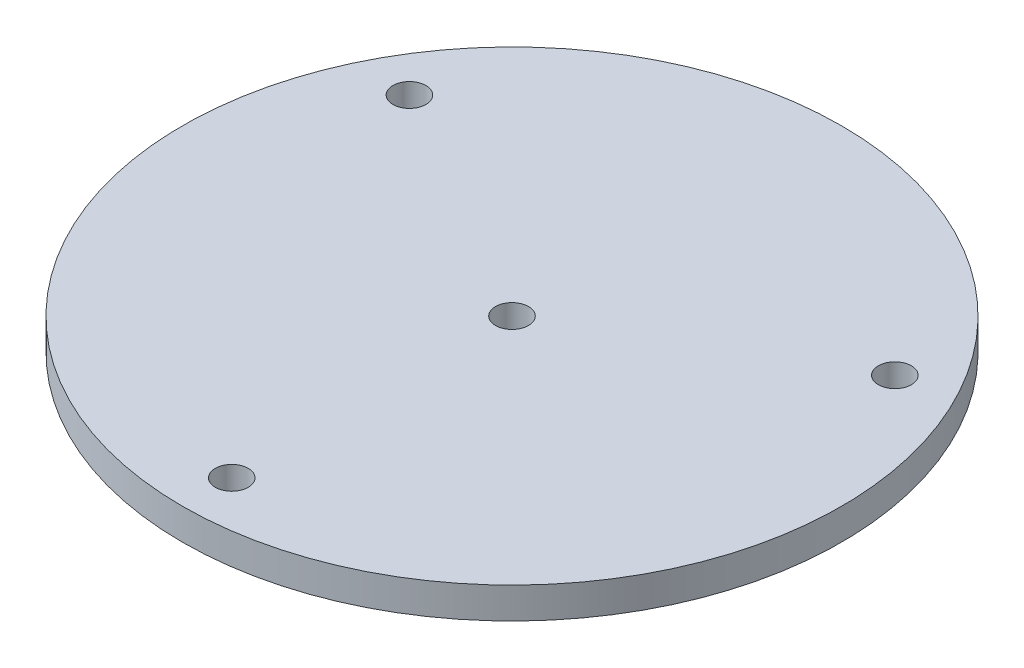
ISO-10303-21;
HEADER;
FILE_DESCRIPTION(('STEP AP214'),'2;1');
FILE_NAME('part.step','',(''),(''),'','','');
FILE_SCHEMA(('AUTOMOTIVE_DESIGN { 1 0 10303 214 1 1 1 1 }'));
ENDSEC;
DATA;
#1=APPLICATION_CONTEXT('core data for automotive mechanical design processes');
#2=APPLICATION_PROTOCOL_DEFINITION('international standard','automotive_design',2000,#1);
#3=PRODUCT_CONTEXT('',#1,'mechanical');
#4=PRODUCT('Part','Part','',(#3));
#5=PRODUCT_RELATED_PRODUCT_CATEGORY('part','',(#4));
#6=PRODUCT_DEFINITION_FORMATION('','',#4);
#7=PRODUCT_DEFINITION_CONTEXT('part definition',#1,'design');
#8=PRODUCT_DEFINITION('design','',#6,#7);
#9=PRODUCT_DEFINITION_SHAPE('','',#8);
#10=(LENGTH_UNIT() NAMED_UNIT(*) SI_UNIT(.MILLI.,.METRE.));
#11=(NAMED_UNIT(*) PLANE_ANGLE_UNIT() SI_UNIT($,.RADIAN.));
#12=(NAMED_UNIT(*) SI_UNIT($,.STERADIAN.) SOLID_ANGLE_UNIT());
#13=UNCERTAINTY_MEASURE_WITH_UNIT(LENGTH_MEASURE(1.E-05),#10,'distance_accuracy_value','');
#14=(GEOMETRIC_REPRESENTATION_CONTEXT(3) GLOBAL_UNCERTAINTY_ASSIGNED_CONTEXT((#13)) GLOBAL_UNIT_ASSIGNED_CONTEXT((#10,
#11,#12)) REPRESENTATION_CONTEXT('',''));
#15=CARTESIAN_POINT('',(0.,0.,0.));
#16=DIRECTION('',(0.,0.,1.));
#17=DIRECTION('',(1.,0.,0.));
#18=AXIS2_PLACEMENT_3D('',#15,#16,#17);
#19=CARTESIAN_POINT('',(0.,6.,0.));
#20=DIRECTION('',(0.,1.,0.));
#21=DIRECTION('',(0.,0.,1.));
#22=AXIS2_PLACEMENT_3D('',#19,#20,#21);
#23=PLANE('',#22);
#24=CARTESIAN_POINT('',(46.7657182145212,6.,-27.0002));
#25=DIRECTION('',(0.,1.,0.));
#26=DIRECTION('',(0.,0.,1.));
#27=AXIS2_PLACEMENT_3D('',#24,#25,#26);
#28=CIRCLE('',#27,3.17499999999999);
#29=CARTESIAN_POINT('',(46.7657182145212,6.,-23.8252));
#30=VERTEX_POINT('',#29);
#31=EDGE_CURVE('E89',#30,#30,#28,.T.);
#32=ORIENTED_EDGE('',*,*,#31,.F.);
#33=EDGE_LOOP('',(#32));
#34=FACE_BOUND('',#33,.T.);
#35=CARTESIAN_POINT('',(0.,6.,0.));
#36=DIRECTION('',(0.,1.,0.));
#37=DIRECTION('',(0.,0.,1.));
#38=AXIS2_PLACEMENT_3D('',#35,#36,#37);
#39=CIRCLE('',#38,3.175);
#40=CARTESIAN_POINT('',(0.,6.,3.175));
#41=VERTEX_POINT('',#40);
#42=EDGE_CURVE('E78',#41,#41,#39,.T.);
#43=ORIENTED_EDGE('',*,*,#42,.F.);
#44=EDGE_LOOP('',(#43));
#45=FACE_BOUND('',#44,.T.);
#46=CARTESIAN_POINT('',(0.,6.,0.));
#47=DIRECTION('',(0.,1.,0.));
#48=DIRECTION('',(0.,0.,1.));
#49=AXIS2_PLACEMENT_3D('',#46,#47,#48);
#50=CIRCLE('',#49,63.5);
#51=CARTESIAN_POINT('',(0.,6.,63.5));
#52=VERTEX_POINT('',#51);
#53=EDGE_CURVE('E11',#52,#52,#50,.T.);
#54=ORIENTED_EDGE('',*,*,#53,.T.);
#55=EDGE_LOOP('',(#54));
#56=FACE_BOUND('',#55,.T.);
#57=CARTESIAN_POINT('',(0.,6.,54.0004));
#58=DIRECTION('',(0.,1.,0.));
#59=DIRECTION('',(0.,0.,1.));
#60=AXIS2_PLACEMENT_3D('',#57,#58,#59);
#61=CIRCLE('',#60,3.175);
#62=CARTESIAN_POINT('',(0.,6.,57.1754));
#63=VERTEX_POINT('',#62);
#64=EDGE_CURVE('E83',#63,#63,#61,.T.);
#65=ORIENTED_EDGE('',*,*,#64,.F.);
#66=EDGE_LOOP('',(#65));
#67=FACE_BOUND('',#66,.T.);
#68=CARTESIAN_POINT('',(-46.7657182145212,6.,-27.0002));
#69=DIRECTION('',(0.,1.,0.));
#70=DIRECTION('',(0.,0.,1.));
#71=AXIS2_PLACEMENT_3D('',#68,#69,#70);
#72=CIRCLE('',#71,3.175);
#73=CARTESIAN_POINT('',(-46.7657182145212,6.,-23.8252));
#74=VERTEX_POINT('',#73);
#75=EDGE_CURVE('E95',#74,#74,#72,.T.);
#76=ORIENTED_EDGE('',*,*,#75,.F.);
#77=EDGE_LOOP('',(#76));
#78=FACE_BOUND('',#77,.T.);
#79=ADVANCED_FACE('F67',(#34,#45,#56,#67,#78),#23,.T.);
#80=CARTESIAN_POINT('',(0.,0.,0.));
#81=DIRECTION('',(0.,1.,0.));
#82=DIRECTION('',(0.,0.,1.));
#83=AXIS2_PLACEMENT_3D('',#80,#81,#82);
#84=PLANE('',#83);
#85=CARTESIAN_POINT('',(0.,0.,0.));
#86=DIRECTION('',(0.,1.,0.));
#87=DIRECTION('',(0.,0.,1.));
#88=AXIS2_PLACEMENT_3D('',#85,#86,#87);
#89=CIRCLE('',#88,63.5);
#90=CARTESIAN_POINT('',(0.,0.,63.5));
#91=VERTEX_POINT('',#90);
#92=EDGE_CURVE('E71',#91,#91,#89,.T.);
#93=ORIENTED_EDGE('',*,*,#92,.F.);
#94=EDGE_LOOP('',(#93));
#95=FACE_BOUND('',#94,.T.);
#96=CARTESIAN_POINT('',(0.,0.,0.));
#97=DIRECTION('',(0.,1.,0.));
#98=DIRECTION('',(0.,0.,1.));
#99=AXIS2_PLACEMENT_3D('',#96,#97,#98);
#100=CIRCLE('',#99,3.175);
#101=CARTESIAN_POINT('',(0.,0.,3.175));
#102=VERTEX_POINT('',#101);
#103=EDGE_CURVE('E80',#102,#102,#100,.T.);
#104=ORIENTED_EDGE('',*,*,#103,.T.);
#105=EDGE_LOOP('',(#104));
#106=FACE_BOUND('',#105,.T.);
#107=CARTESIAN_POINT('',(0.,0.,54.0004));
#108=DIRECTION('',(0.,1.,0.));
#109=DIRECTION('',(0.,0.,1.));
#110=AXIS2_PLACEMENT_3D('',#107,#108,#109);
#111=CIRCLE('',#110,3.175);
#112=CARTESIAN_POINT('',(0.,0.,57.1754));
#113=VERTEX_POINT('',#112);
#114=EDGE_CURVE('E86',#113,#113,#111,.T.);
#115=ORIENTED_EDGE('',*,*,#114,.T.);
#116=EDGE_LOOP('',(#115));
#117=FACE_BOUND('',#116,.T.);
#118=CARTESIAN_POINT('',(46.7657182145212,0.,-27.0002));
#119=DIRECTION('',(0.,1.,0.));
#120=DIRECTION('',(0.,0.,1.));
#121=AXIS2_PLACEMENT_3D('',#118,#119,#120);
#122=CIRCLE('',#121,3.17499999999999);
#123=CARTESIAN_POINT('',(46.7657182145212,0.,-23.8252));
#124=VERTEX_POINT('',#123);
#125=EDGE_CURVE('E92',#124,#124,#122,.T.);
#126=ORIENTED_EDGE('',*,*,#125,.T.);
#127=EDGE_LOOP('',(#126));
#128=FACE_BOUND('',#127,.T.);
#129=CARTESIAN_POINT('',(-46.7657182145212,0.,-27.0002));
#130=DIRECTION('',(0.,1.,0.));
#131=DIRECTION('',(0.,0.,1.));
#132=AXIS2_PLACEMENT_3D('',#129,#130,#131);
#133=CIRCLE('',#132,3.175);
#134=CARTESIAN_POINT('',(-46.7657182145212,0.,-23.8252));
#135=VERTEX_POINT('',#134);
#136=EDGE_CURVE('E98',#135,#135,#133,.T.);
#137=ORIENTED_EDGE('',*,*,#136,.T.);
#138=EDGE_LOOP('',(#137));
#139=FACE_BOUND('',#138,.T.);
#140=ADVANCED_FACE('F108',(#95,#106,#117,#128,#139),#84,.F.);
#141=CARTESIAN_POINT('',(0.,6.,0.));
#142=DIRECTION('',(0.,-1.,0.));
#143=DIRECTION('',(0.,0.,-1.));
#144=AXIS2_PLACEMENT_3D('',#141,#142,#143);
#145=CYLINDRICAL_SURFACE('',#144,63.5);
#146=ORIENTED_EDGE('',*,*,#53,.F.);
#147=EDGE_LOOP('',(#146));
#148=FACE_BOUND('',#147,.T.);
#149=ORIENTED_EDGE('',*,*,#92,.T.);
#150=EDGE_LOOP('',(#149));
#151=FACE_BOUND('',#150,.T.);
#152=ADVANCED_FACE('F69',(#148,#151),#145,.T.);
#153=CARTESIAN_POINT('',(0.,6.,0.));
#154=DIRECTION('',(0.,-1.,0.));
#155=DIRECTION('',(0.,0.,-1.));
#156=AXIS2_PLACEMENT_3D('',#153,#154,#155);
#157=CYLINDRICAL_SURFACE('',#156,3.175);
#158=ORIENTED_EDGE('',*,*,#42,.T.);
#159=EDGE_LOOP('',(#158));
#160=FACE_BOUND('',#159,.T.);
#161=ORIENTED_EDGE('',*,*,#103,.F.);
#162=EDGE_LOOP('',(#161));
#163=FACE_BOUND('',#162,.T.);
#164=ADVANCED_FACE('F118',(#160,#163),#157,.F.);
#165=CARTESIAN_POINT('',(0.,6.,54.0004));
#166=DIRECTION('',(0.,-1.,0.));
#167=DIRECTION('',(0.,0.,-1.));
#168=AXIS2_PLACEMENT_3D('',#165,#166,#167);
#169=CYLINDRICAL_SURFACE('',#168,3.175);
#170=ORIENTED_EDGE('',*,*,#64,.T.);
#171=EDGE_LOOP('',(#170));
#172=FACE_BOUND('',#171,.T.);
#173=ORIENTED_EDGE('',*,*,#114,.F.);
#174=EDGE_LOOP('',(#173));
#175=FACE_BOUND('',#174,.T.);
#176=ADVANCED_FACE('F121',(#172,#175),#169,.F.);
#177=CARTESIAN_POINT('',(46.7657182145212,6.,-27.0002));
#178=DIRECTION('',(0.,-1.,0.));
#179=DIRECTION('',(0.,0.,-1.));
#180=AXIS2_PLACEMENT_3D('',#177,#178,#179);
#181=CYLINDRICAL_SURFACE('',#180,3.17499999999999);
#182=ORIENTED_EDGE('',*,*,#31,.T.);
#183=EDGE_LOOP('',(#182));
#184=FACE_BOUND('',#183,.T.);
#185=ORIENTED_EDGE('',*,*,#125,.F.);
#186=EDGE_LOOP('',(#185));
#187=FACE_BOUND('',#186,.T.);
#188=ADVANCED_FACE('F125',(#184,#187),#181,.F.);
#189=CARTESIAN_POINT('',(-46.7657182145212,6.,-27.0002));
#190=DIRECTION('',(0.,-1.,0.));
#191=DIRECTION('',(0.,0.,-1.));
#192=AXIS2_PLACEMENT_3D('',#189,#190,#191);
#193=CYLINDRICAL_SURFACE('',#192,3.175);
#194=ORIENTED_EDGE('',*,*,#75,.T.);
#195=EDGE_LOOP('',(#194));
#196=FACE_BOUND('',#195,.T.);
#197=ORIENTED_EDGE('',*,*,#136,.F.);
#198=EDGE_LOOP('',(#197));
#199=FACE_BOUND('',#198,.T.);
#200=ADVANCED_FACE('F104',(#196,#199),#193,.F.);
#201=CLOSED_SHELL('',(#79,#140,#152,#164,#176,#188,#200));
#202=MANIFOLD_SOLID_BREP('B2',#201);
#203=ADVANCED_BREP_SHAPE_REPRESENTATION('',(#18,#202),#14);
#204=SHAPE_DEFINITION_REPRESENTATION(#9,#203);
ENDSEC;
END-ISO-10303-21;
